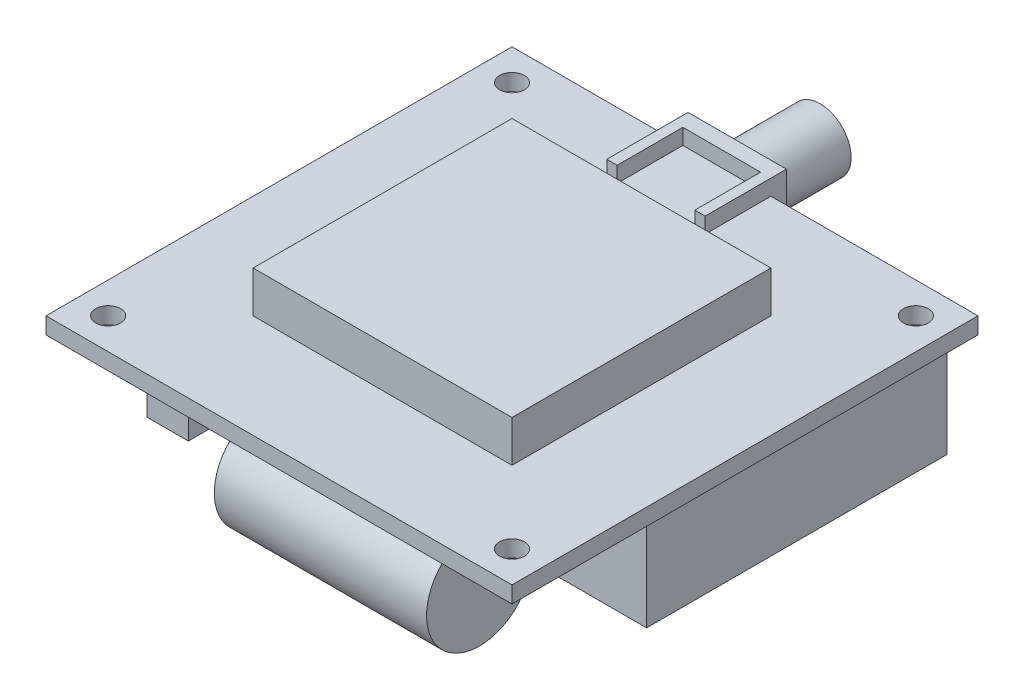
ISO-10303-21;
HEADER;
FILE_DESCRIPTION(('STEP AP214'),'2;1');
FILE_NAME('part.step','',(''),(''),'','','');
FILE_SCHEMA(('AUTOMOTIVE_DESIGN { 1 0 10303 214 1 1 1 1 }'));
ENDSEC;
DATA;
#1=APPLICATION_CONTEXT('core data for automotive mechanical design processes');
#2=APPLICATION_PROTOCOL_DEFINITION('international standard','automotive_design',2000,#1);
#3=PRODUCT_CONTEXT('',#1,'mechanical');
#4=PRODUCT('Part','Part','',(#3));
#5=PRODUCT_RELATED_PRODUCT_CATEGORY('part','',(#4));
#6=PRODUCT_DEFINITION_FORMATION('','',#4);
#7=PRODUCT_DEFINITION_CONTEXT('part definition',#1,'design');
#8=PRODUCT_DEFINITION('design','',#6,#7);
#9=PRODUCT_DEFINITION_SHAPE('','',#8);
#10=(LENGTH_UNIT() NAMED_UNIT(*) SI_UNIT(.MILLI.,.METRE.));
#11=(NAMED_UNIT(*) PLANE_ANGLE_UNIT() SI_UNIT($,.RADIAN.));
#12=(NAMED_UNIT(*) SI_UNIT($,.STERADIAN.) SOLID_ANGLE_UNIT());
#13=UNCERTAINTY_MEASURE_WITH_UNIT(LENGTH_MEASURE(1.E-05),#10,'distance_accuracy_value','');
#14=(GEOMETRIC_REPRESENTATION_CONTEXT(3) GLOBAL_UNCERTAINTY_ASSIGNED_CONTEXT((#13)) GLOBAL_UNIT_ASSIGNED_CONTEXT((#10,
#11,#12)) REPRESENTATION_CONTEXT('',''));
#15=CARTESIAN_POINT('',(0.,0.,0.));
#16=DIRECTION('',(0.,0.,1.));
#17=DIRECTION('',(1.,0.,0.));
#18=AXIS2_PLACEMENT_3D('',#15,#16,#17);
#19=CARTESIAN_POINT('',(-17.4,-5.1,-0.999999999999997));
#20=DIRECTION('',(0.,0.,-1.));
#21=DIRECTION('',(-1.,0.,0.));
#22=AXIS2_PLACEMENT_3D('',#19,#20,#21);
#23=CYLINDRICAL_SURFACE('',#22,5.1);
#24=CARTESIAN_POINT('',(-17.4,-5.1,-0.999999999999997));
#25=DIRECTION('',(0.,0.,-1.));
#26=DIRECTION('',(-1.,0.,0.));
#27=AXIS2_PLACEMENT_3D('',#24,#25,#26);
#28=CIRCLE('',#27,5.1);
#29=CARTESIAN_POINT('',(-22.5,-5.1,-0.999999999999997));
#30=VERTEX_POINT('',#29);
#31=EDGE_CURVE('E11',#30,#30,#28,.T.);
#32=ORIENTED_EDGE('',*,*,#31,.T.);
#33=EDGE_LOOP('',(#32));
#34=FACE_BOUND('',#33,.T.);
#35=CARTESIAN_POINT('',(-17.4,-5.1,-21.5));
#36=DIRECTION('',(0.,0.,-1.));
#37=DIRECTION('',(-1.,0.,0.));
#38=AXIS2_PLACEMENT_3D('',#35,#36,#37);
#39=CIRCLE('',#38,5.1);
#40=CARTESIAN_POINT('',(-22.5,-5.1,-21.5));
#41=VERTEX_POINT('',#40);
#42=EDGE_CURVE('E43',#41,#41,#39,.T.);
#43=ORIENTED_EDGE('',*,*,#42,.F.);
#44=EDGE_LOOP('',(#43));
#45=FACE_BOUND('',#44,.T.);
#46=ADVANCED_FACE('F40',(#34,#45),#23,.T.);
#47=CARTESIAN_POINT('',(-17.4,-5.1,-0.999999999999997));
#48=DIRECTION('',(0.,0.,-1.));
#49=DIRECTION('',(-1.,0.,0.));
#50=AXIS2_PLACEMENT_3D('',#47,#48,#49);
#51=PLANE('',#50);
#52=ORIENTED_EDGE('',*,*,#31,.F.);
#53=EDGE_LOOP('',(#52));
#54=FACE_BOUND('',#53,.T.);
#55=ADVANCED_FACE('F55',(#54),#51,.F.);
#56=CARTESIAN_POINT('',(-17.4,-5.1,-21.5));
#57=DIRECTION('',(0.,0.,-1.));
#58=DIRECTION('',(-1.,0.,0.));
#59=AXIS2_PLACEMENT_3D('',#56,#57,#58);
#60=PLANE('',#59);
#61=ORIENTED_EDGE('',*,*,#42,.T.);
#62=EDGE_LOOP('',(#61));
#63=FACE_BOUND('',#62,.T.);
#64=ADVANCED_FACE('F52',(#63),#60,.T.);
#65=CLOSED_SHELL('',(#46,#55,#64));
#66=MANIFOLD_SOLID_BREP('B2',#65);
#67=CARTESIAN_POINT('',(-6.25,-5.1,17.4));
#68=DIRECTION('',(1.,0.,0.));
#69=DIRECTION('',(0.,0.,-1.));
#70=AXIS2_PLACEMENT_3D('',#67,#68,#69);
#71=CYLINDRICAL_SURFACE('',#70,5.1);
#72=CARTESIAN_POINT('',(-6.25,-5.1,17.4));
#73=DIRECTION('',(1.,0.,0.));
#74=DIRECTION('',(0.,0.,-1.));
#75=AXIS2_PLACEMENT_3D('',#72,#73,#74);
#76=CIRCLE('',#75,5.1);
#77=CARTESIAN_POINT('',(-6.25,-5.1,12.3));
#78=VERTEX_POINT('',#77);
#79=EDGE_CURVE('E39',#78,#78,#76,.T.);
#80=ORIENTED_EDGE('',*,*,#79,.T.);
#81=EDGE_LOOP('',(#80));
#82=FACE_BOUND('',#81,.T.);
#83=CARTESIAN_POINT('',(14.25,-5.1,17.4));
#84=DIRECTION('',(1.,0.,0.));
#85=DIRECTION('',(0.,0.,-1.));
#86=AXIS2_PLACEMENT_3D('',#83,#84,#85);
#87=CIRCLE('',#86,5.1);
#88=CARTESIAN_POINT('',(14.25,-5.1,12.3));
#89=VERTEX_POINT('',#88);
#90=EDGE_CURVE('E93',#89,#89,#87,.T.);
#91=ORIENTED_EDGE('',*,*,#90,.F.);
#92=EDGE_LOOP('',(#91));
#93=FACE_BOUND('',#92,.T.);
#94=ADVANCED_FACE('F90',(#82,#93),#71,.T.);
#95=CARTESIAN_POINT('',(-6.25,-5.1,17.4));
#96=DIRECTION('',(1.,0.,0.));
#97=DIRECTION('',(0.,0.,-1.));
#98=AXIS2_PLACEMENT_3D('',#95,#96,#97);
#99=PLANE('',#98);
#100=ORIENTED_EDGE('',*,*,#79,.F.);
#101=EDGE_LOOP('',(#100));
#102=FACE_BOUND('',#101,.T.);
#103=ADVANCED_FACE('F105',(#102),#99,.F.);
#104=CARTESIAN_POINT('',(14.25,-5.1,17.4));
#105=DIRECTION('',(1.,0.,0.));
#106=DIRECTION('',(0.,0.,-1.));
#107=AXIS2_PLACEMENT_3D('',#104,#105,#106);
#108=PLANE('',#107);
#109=ORIENTED_EDGE('',*,*,#90,.T.);
#110=EDGE_LOOP('',(#109));
#111=FACE_BOUND('',#110,.T.);
#112=ADVANCED_FACE('F102',(#111),#108,.T.);
#113=CLOSED_SHELL('',(#94,#103,#112));
#114=MANIFOLD_SOLID_BREP('B6',#113);
#115=CARTESIAN_POINT('',(0.,1.6,0.));
#116=DIRECTION('',(0.,-1.,0.));
#117=DIRECTION('',(0.,0.,-1.));
#118=AXIS2_PLACEMENT_3D('',#115,#116,#117);
#119=PLANE('',#118);
#120=DIRECTION('',(0.,0.,-1.));
#121=VECTOR('',#120,1.);
#122=CARTESIAN_POINT('',(2.5,1.6,-16.15));
#123=LINE('',#122,#121);
#124=CARTESIAN_POINT('',(2.5,1.6,-16.15));
#125=VERTEX_POINT('',#124);
#126=CARTESIAN_POINT('',(2.49999999999999,1.6,-22.5));
#127=VERTEX_POINT('',#126);
#128=EDGE_CURVE('E377',#125,#127,#123,.T.);
#129=ORIENTED_EDGE('',*,*,#128,.F.);
#130=DIRECTION('',(1.,0.,0.));
#131=VECTOR('',#130,1.);
#132=CARTESIAN_POINT('',(2.5,1.6,-16.15));
#133=LINE('',#132,#131);
#134=CARTESIAN_POINT('',(1.5,1.6,-16.15));
#135=VERTEX_POINT('',#134);
#136=EDGE_CURVE('E375',#135,#125,#133,.T.);
#137=ORIENTED_EDGE('',*,*,#136,.F.);
#138=DIRECTION('',(0.,0.,-1.));
#139=VECTOR('',#138,1.);
#140=CARTESIAN_POINT('',(1.5,1.6,-16.15));
#141=LINE('',#140,#139);
#142=CARTESIAN_POINT('',(1.5,1.6,-22.5));
#143=VERTEX_POINT('',#142);
#144=EDGE_CURVE('E380',#135,#143,#141,.T.);
#145=ORIENTED_EDGE('',*,*,#144,.T.);
#146=DIRECTION('',(-1.,0.,0.));
#147=VECTOR('',#146,1.);
#148=CARTESIAN_POINT('',(-22.5,1.6,-22.5));
#149=LINE('',#148,#147);
#150=CARTESIAN_POINT('',(-6.,1.6,-22.5));
#151=VERTEX_POINT('',#150);
#152=EDGE_CURVE('E500',#143,#151,#149,.T.);
#153=ORIENTED_EDGE('',*,*,#152,.T.);
#154=DIRECTION('',(0.,0.,-1.));
#155=VECTOR('',#154,1.);
#156=CARTESIAN_POINT('',(-6.,1.6,-16.15));
#157=LINE('',#156,#155);
#158=CARTESIAN_POINT('',(-6.,1.6,-16.15));
#159=VERTEX_POINT('',#158);
#160=EDGE_CURVE('E399',#159,#151,#157,.T.);
#161=ORIENTED_EDGE('',*,*,#160,.F.);
#162=DIRECTION('',(1.,0.,0.));
#163=VECTOR('',#162,1.);
#164=CARTESIAN_POINT('',(-7.,1.6,-16.15));
#165=LINE('',#164,#163);
#166=CARTESIAN_POINT('',(-7.,1.6,-16.15));
#167=VERTEX_POINT('',#166);
#168=EDGE_CURVE('E388',#167,#159,#165,.T.);
#169=ORIENTED_EDGE('',*,*,#168,.F.);
#170=DIRECTION('',(0.,0.,-1.));
#171=VECTOR('',#170,1.);
#172=CARTESIAN_POINT('',(-7.,1.6,-16.15));
#173=LINE('',#172,#171);
#174=CARTESIAN_POINT('',(-7.,1.6,-22.5));
#175=VERTEX_POINT('',#174);
#176=EDGE_CURVE('E402',#167,#175,#173,.T.);
#177=ORIENTED_EDGE('',*,*,#176,.T.);
#178=CARTESIAN_POINT('',(-22.5,1.6,-22.5));
#179=VERTEX_POINT('',#178);
#180=EDGE_CURVE('E494',#175,#179,#149,.T.);
#181=ORIENTED_EDGE('',*,*,#180,.T.);
#182=DIRECTION('',(0.,0.,1.));
#183=VECTOR('',#182,1.);
#184=CARTESIAN_POINT('',(-22.5,1.6,22.5));
#185=LINE('',#184,#183);
#186=CARTESIAN_POINT('',(-22.5,1.6,22.5));
#187=VERTEX_POINT('',#186);
#188=EDGE_CURVE('E499',#179,#187,#185,.T.);
#189=ORIENTED_EDGE('',*,*,#188,.T.);
#190=DIRECTION('',(1.,0.,0.));
#191=VECTOR('',#190,1.);
#192=CARTESIAN_POINT('',(-22.5,1.6,22.5));
#193=LINE('',#192,#191);
#194=CARTESIAN_POINT('',(22.5,1.6,22.5));
#195=VERTEX_POINT('',#194);
#196=EDGE_CURVE('E502',#187,#195,#193,.T.);
#197=ORIENTED_EDGE('',*,*,#196,.T.);
#198=DIRECTION('',(0.,0.,-1.));
#199=VECTOR('',#198,1.);
#200=CARTESIAN_POINT('',(22.5,1.6,22.5));
#201=LINE('',#200,#199);
#202=CARTESIAN_POINT('',(22.5,1.6,-22.5));
#203=VERTEX_POINT('',#202);
#204=EDGE_CURVE('E491',#195,#203,#201,.T.);
#205=ORIENTED_EDGE('',*,*,#204,.T.);
#206=EDGE_CURVE('E496',#203,#127,#149,.T.);
#207=ORIENTED_EDGE('',*,*,#206,.T.);
#208=EDGE_LOOP('',(#129,#137,#145,#153,#161,#169,#177,#181,#189,#197,#205,#207));
#209=FACE_BOUND('',#208,.T.);
#210=CARTESIAN_POINT('',(19.5,1.6,-19.5));
#211=DIRECTION('',(0.,-1.,0.));
#212=DIRECTION('',(0.,0.,-1.));
#213=AXIS2_PLACEMENT_3D('',#210,#211,#212);
#214=CIRCLE('',#213,1.2);
#215=CARTESIAN_POINT('',(19.5,1.6,-20.7));
#216=VERTEX_POINT('',#215);
#217=EDGE_CURVE('E487',#216,#216,#214,.T.);
#218=ORIENTED_EDGE('',*,*,#217,.T.);
#219=EDGE_LOOP('',(#218));
#220=FACE_BOUND('',#219,.T.);
#221=CARTESIAN_POINT('',(-19.5,1.6,19.5));
#222=DIRECTION('',(0.,-1.,0.));
#223=DIRECTION('',(0.,0.,-1.));
#224=AXIS2_PLACEMENT_3D('',#221,#222,#223);
#225=CIRCLE('',#224,1.2);
#226=CARTESIAN_POINT('',(-19.5,1.6,18.3));
#227=VERTEX_POINT('',#226);
#228=EDGE_CURVE('E484',#227,#227,#225,.T.);
#229=ORIENTED_EDGE('',*,*,#228,.T.);
#230=EDGE_LOOP('',(#229));
#231=FACE_BOUND('',#230,.T.);
#232=CARTESIAN_POINT('',(-19.5,1.6,-19.5));
#233=DIRECTION('',(0.,-1.,0.));
#234=DIRECTION('',(0.,0.,-1.));
#235=AXIS2_PLACEMENT_3D('',#232,#233,#234);
#236=CIRCLE('',#235,1.2);
#237=CARTESIAN_POINT('',(-19.5,1.6,-20.7));
#238=VERTEX_POINT('',#237);
#239=EDGE_CURVE('E478',#238,#238,#236,.T.);
#240=ORIENTED_EDGE('',*,*,#239,.T.);
#241=EDGE_LOOP('',(#240));
#242=FACE_BOUND('',#241,.T.);
#243=CARTESIAN_POINT('',(19.5,1.6,19.5));
#244=DIRECTION('',(0.,-1.,0.));
#245=DIRECTION('',(0.,0.,-1.));
#246=AXIS2_PLACEMENT_3D('',#243,#244,#245);
#247=CIRCLE('',#246,1.2);
#248=CARTESIAN_POINT('',(19.5,1.6,18.3));
#249=VERTEX_POINT('',#248);
#250=EDGE_CURVE('E472',#249,#249,#247,.T.);
#251=ORIENTED_EDGE('',*,*,#250,.T.);
#252=EDGE_LOOP('',(#251));
#253=FACE_BOUND('',#252,.T.);
#254=DIRECTION('',(0.,0.,-1.));
#255=VECTOR('',#254,1.);
#256=CARTESIAN_POINT('',(12.5,1.6,-12.5));
#257=LINE('',#256,#255);
#258=CARTESIAN_POINT('',(12.5,1.6,12.5));
#259=VERTEX_POINT('',#258);
#260=CARTESIAN_POINT('',(12.5,1.6,-12.5));
#261=VERTEX_POINT('',#260);
#262=EDGE_CURVE('E332',#259,#261,#257,.T.);
#263=ORIENTED_EDGE('',*,*,#262,.F.);
#264=DIRECTION('',(1.,0.,0.));
#265=VECTOR('',#264,1.);
#266=CARTESIAN_POINT('',(12.5,1.6,12.5));
#267=LINE('',#266,#265);
#268=CARTESIAN_POINT('',(-12.5,1.6,12.5));
#269=VERTEX_POINT('',#268);
#270=EDGE_CURVE('E329',#269,#259,#267,.T.);
#271=ORIENTED_EDGE('',*,*,#270,.F.);
#272=DIRECTION('',(0.,0.,1.));
#273=VECTOR('',#272,1.);
#274=CARTESIAN_POINT('',(-12.5,1.6,-12.5));
#275=LINE('',#274,#273);
#276=CARTESIAN_POINT('',(-12.5,1.6,-12.5));
#277=VERTEX_POINT('',#276);
#278=EDGE_CURVE('E153',#277,#269,#275,.T.);
#279=ORIENTED_EDGE('',*,*,#278,.F.);
#280=DIRECTION('',(-1.,0.,0.));
#281=VECTOR('',#280,1.);
#282=CARTESIAN_POINT('',(12.5,1.6,-12.5));
#283=LINE('',#282,#281);
#284=EDGE_CURVE('E148',#261,#277,#283,.T.);
#285=ORIENTED_EDGE('',*,*,#284,.F.);
#286=EDGE_LOOP('',(#263,#271,#279,#285));
#287=FACE_BOUND('',#286,.T.);
#288=ADVANCED_FACE('F131',(#209,#220,#231,#242,#253,#287),#119,.F.);
#289=CARTESIAN_POINT('',(0.,0.,0.));
#290=DIRECTION('',(0.,-1.,0.));
#291=DIRECTION('',(0.,0.,-1.));
#292=AXIS2_PLACEMENT_3D('',#289,#290,#291);
#293=PLANE('',#292);
#294=DIRECTION('',(0.,0.,-1.));
#295=VECTOR('',#294,1.);
#296=CARTESIAN_POINT('',(22.5,0.,22.5));
#297=LINE('',#296,#295);
#298=CARTESIAN_POINT('',(22.5,0.,22.5));
#299=VERTEX_POINT('',#298);
#300=CARTESIAN_POINT('',(22.5,0.,-22.5));
#301=VERTEX_POINT('',#300);
#302=EDGE_CURVE('E490',#299,#301,#297,.T.);
#303=ORIENTED_EDGE('',*,*,#302,.F.);
#304=DIRECTION('',(1.,0.,0.));
#305=VECTOR('',#304,1.);
#306=CARTESIAN_POINT('',(-22.5,0.,22.5));
#307=LINE('',#306,#305);
#308=CARTESIAN_POINT('',(-22.5,0.,22.5));
#309=VERTEX_POINT('',#308);
#310=EDGE_CURVE('E495',#309,#299,#307,.T.);
#311=ORIENTED_EDGE('',*,*,#310,.F.);
#312=DIRECTION('',(0.,0.,1.));
#313=VECTOR('',#312,1.);
#314=CARTESIAN_POINT('',(-22.5,0.,22.5));
#315=LINE('',#314,#313);
#316=CARTESIAN_POINT('',(-22.5,0.,-22.5));
#317=VERTEX_POINT('',#316);
#318=EDGE_CURVE('E510',#317,#309,#315,.T.);
#319=ORIENTED_EDGE('',*,*,#318,.F.);
#320=DIRECTION('',(-1.,0.,0.));
#321=VECTOR('',#320,1.);
#322=CARTESIAN_POINT('',(-22.5,0.,-22.5));
#323=LINE('',#322,#321);
#324=CARTESIAN_POINT('',(-7.,0.,-22.5));
#325=VERTEX_POINT('',#324);
#326=EDGE_CURVE('E507',#325,#317,#323,.T.);
#327=ORIENTED_EDGE('',*,*,#326,.F.);
#328=CARTESIAN_POINT('',(2.5,0.,-22.5));
#329=VERTEX_POINT('',#328);
#330=EDGE_CURVE('E511',#329,#325,#323,.T.);
#331=ORIENTED_EDGE('',*,*,#330,.F.);
#332=EDGE_CURVE('E508',#301,#329,#323,.T.);
#333=ORIENTED_EDGE('',*,*,#332,.F.);
#334=EDGE_LOOP('',(#303,#311,#319,#327,#331,#333));
#335=FACE_BOUND('',#334,.T.);
#336=CARTESIAN_POINT('',(-19.5,0.,19.5));
#337=DIRECTION('',(0.,-1.,0.));
#338=DIRECTION('',(0.,0.,-1.));
#339=AXIS2_PLACEMENT_3D('',#336,#337,#338);
#340=CIRCLE('',#339,1.2);
#341=CARTESIAN_POINT('',(-19.5,0.,18.3));
#342=VERTEX_POINT('',#341);
#343=EDGE_CURVE('E481',#342,#342,#340,.T.);
#344=ORIENTED_EDGE('',*,*,#343,.F.);
#345=EDGE_LOOP('',(#344));
#346=FACE_BOUND('',#345,.T.);
#347=CARTESIAN_POINT('',(-19.5,0.,-19.5));
#348=DIRECTION('',(0.,-1.,0.));
#349=DIRECTION('',(0.,0.,-1.));
#350=AXIS2_PLACEMENT_3D('',#347,#348,#349);
#351=CIRCLE('',#350,1.2);
#352=CARTESIAN_POINT('',(-19.5,0.,-20.7));
#353=VERTEX_POINT('',#352);
#354=EDGE_CURVE('E475',#353,#353,#351,.T.);
#355=ORIENTED_EDGE('',*,*,#354,.F.);
#356=EDGE_LOOP('',(#355));
#357=FACE_BOUND('',#356,.T.);
#358=CARTESIAN_POINT('',(19.5,0.,19.5));
#359=DIRECTION('',(0.,-1.,0.));
#360=DIRECTION('',(0.,0.,-1.));
#361=AXIS2_PLACEMENT_3D('',#358,#359,#360);
#362=CIRCLE('',#361,1.2);
#363=CARTESIAN_POINT('',(19.5,0.,18.3));
#364=VERTEX_POINT('',#363);
#365=EDGE_CURVE('E469',#364,#364,#362,.T.);
#366=ORIENTED_EDGE('',*,*,#365,.F.);
#367=EDGE_LOOP('',(#366));
#368=FACE_BOUND('',#367,.T.);
#369=DIRECTION('',(1.,0.,0.));
#370=VECTOR('',#369,1.);
#371=CARTESIAN_POINT('',(-10.,0.,-21.));
#372=LINE('',#371,#370);
#373=CARTESIAN_POINT('',(-10.,0.,-21.));
#374=VERTEX_POINT('',#373);
#375=CARTESIAN_POINT('',(21.,0.,-21.));
#376=VERTEX_POINT('',#375);
#377=EDGE_CURVE('E451',#374,#376,#372,.T.);
#378=ORIENTED_EDGE('',*,*,#377,.F.);
#379=DIRECTION('',(0.,0.,-1.));
#380=VECTOR('',#379,1.);
#381=CARTESIAN_POINT('',(-10.,0.,8.00000000000001));
#382=LINE('',#381,#380);
#383=CARTESIAN_POINT('',(-10.,0.,8.00000000000001));
#384=VERTEX_POINT('',#383);
#385=EDGE_CURVE('E437',#384,#374,#382,.T.);
#386=ORIENTED_EDGE('',*,*,#385,.F.);
#387=DIRECTION('',(-1.,0.,0.));
#388=VECTOR('',#387,1.);
#389=CARTESIAN_POINT('',(-10.,0.,8.00000000000001));
#390=LINE('',#389,#388);
#391=CARTESIAN_POINT('',(21.,0.,8.00000000000001));
#392=VERTEX_POINT('',#391);
#393=EDGE_CURVE('E442',#392,#384,#390,.T.);
#394=ORIENTED_EDGE('',*,*,#393,.F.);
#395=DIRECTION('',(0.,0.,1.));
#396=VECTOR('',#395,1.);
#397=CARTESIAN_POINT('',(21.,0.,8.00000000000001));
#398=LINE('',#397,#396);
#399=EDGE_CURVE('E453',#376,#392,#398,.T.);
#400=ORIENTED_EDGE('',*,*,#399,.F.);
#401=EDGE_LOOP('',(#378,#386,#394,#400));
#402=FACE_BOUND('',#401,.T.);
#403=DIRECTION('',(-1.,0.,0.));
#404=VECTOR('',#403,1.);
#405=CARTESIAN_POINT('',(-11.75,0.,19.5));
#406=LINE('',#405,#404);
#407=CARTESIAN_POINT('',(-11.75,0.,19.5));
#408=VERTEX_POINT('',#407);
#409=CARTESIAN_POINT('',(-15.75,0.,19.5));
#410=VERTEX_POINT('',#409);
#411=EDGE_CURVE('E336',#408,#410,#406,.T.);
#412=ORIENTED_EDGE('',*,*,#411,.F.);
#413=DIRECTION('',(0.,0.,1.));
#414=VECTOR('',#413,1.);
#415=CARTESIAN_POINT('',(-11.75,0.,19.5));
#416=LINE('',#415,#414);
#417=CARTESIAN_POINT('',(-11.75,0.,1.7));
#418=VERTEX_POINT('',#417);
#419=EDGE_CURVE('E333',#418,#408,#416,.T.);
#420=ORIENTED_EDGE('',*,*,#419,.F.);
#421=DIRECTION('',(1.,0.,0.));
#422=VECTOR('',#421,1.);
#423=CARTESIAN_POINT('',(-11.75,0.,1.7));
#424=LINE('',#423,#422);
#425=CARTESIAN_POINT('',(-15.75,0.,1.7));
#426=VERTEX_POINT('',#425);
#427=EDGE_CURVE('E346',#426,#418,#424,.T.);
#428=ORIENTED_EDGE('',*,*,#427,.F.);
#429=DIRECTION('',(0.,0.,-1.));
#430=VECTOR('',#429,1.);
#431=CARTESIAN_POINT('',(-15.75,0.,19.5));
#432=LINE('',#431,#430);
#433=EDGE_CURVE('E354',#410,#426,#432,.T.);
#434=ORIENTED_EDGE('',*,*,#433,.F.);
#435=EDGE_LOOP('',(#412,#420,#428,#434));
#436=FACE_BOUND('',#435,.T.);
#437=ADVANCED_FACE('F545',(#335,#346,#357,#368,#402,#436),#293,.T.);
#438=CARTESIAN_POINT('',(0.,0.,-22.5));
#439=DIRECTION('',(0.,0.,1.));
#440=DIRECTION('',(1.,0.,0.));
#441=AXIS2_PLACEMENT_3D('',#438,#439,#440);
#442=PLANE('',#441);
#443=ORIENTED_EDGE('',*,*,#152,.F.);
#444=DIRECTION('',(0.,-1.,0.));
#445=VECTOR('',#444,1.);
#446=CARTESIAN_POINT('',(1.5,3.11510230791612,-22.5));
#447=LINE('',#446,#445);
#448=CARTESIAN_POINT('',(1.5,3.11510230791612,-22.5));
#449=VERTEX_POINT('',#448);
#450=EDGE_CURVE('E367',#449,#143,#447,.T.);
#451=ORIENTED_EDGE('',*,*,#450,.F.);
#452=DIRECTION('',(1.,0.,0.));
#453=VECTOR('',#452,1.);
#454=CARTESIAN_POINT('',(-7.,3.11510230791612,-22.5));
#455=LINE('',#454,#453);
#456=CARTESIAN_POINT('',(-6.,3.11510230791612,-22.5));
#457=VERTEX_POINT('',#456);
#458=EDGE_CURVE('E421',#457,#449,#455,.T.);
#459=ORIENTED_EDGE('',*,*,#458,.F.);
#460=DIRECTION('',(0.,1.,0.));
#461=VECTOR('',#460,1.);
#462=CARTESIAN_POINT('',(-6.,3.11510230791612,-22.5));
#463=LINE('',#462,#461);
#464=EDGE_CURVE('E385',#151,#457,#463,.T.);
#465=ORIENTED_EDGE('',*,*,#464,.F.);
#466=EDGE_LOOP('',(#443,#451,#459,#465));
#467=FACE_BOUND('',#466,.T.);
#468=ADVANCED_FACE('F596',(#467),#442,.T.);
#469=CARTESIAN_POINT('',(-22.5,1.6,-22.5));
#470=DIRECTION('',(0.,0.,1.));
#471=DIRECTION('',(1.,0.,0.));
#472=AXIS2_PLACEMENT_3D('',#469,#470,#471);
#473=PLANE('',#472);
#474=DIRECTION('',(0.,1.,0.));
#475=VECTOR('',#474,1.);
#476=CARTESIAN_POINT('',(-7.,3.11510230791612,-22.5));
#477=LINE('',#476,#475);
#478=EDGE_CURVE('E140',#325,#175,#477,.T.);
#479=ORIENTED_EDGE('',*,*,#478,.F.);
#480=ORIENTED_EDGE('',*,*,#326,.T.);
#481=DIRECTION('',(0.,-1.,0.));
#482=VECTOR('',#481,1.);
#483=CARTESIAN_POINT('',(-22.5,1.6,-22.5));
#484=LINE('',#483,#482);
#485=EDGE_CURVE('E518',#179,#317,#484,.T.);
#486=ORIENTED_EDGE('',*,*,#485,.F.);
#487=ORIENTED_EDGE('',*,*,#180,.F.);
#488=EDGE_LOOP('',(#479,#480,#486,#487));
#489=FACE_BOUND('',#488,.T.);
#490=ADVANCED_FACE('F540',(#489),#473,.F.);
#491=DIRECTION('',(0.,-1.,0.));
#492=VECTOR('',#491,1.);
#493=CARTESIAN_POINT('',(2.5,3.11510230791612,-22.5));
#494=LINE('',#493,#492);
#495=EDGE_CURVE('E426',#127,#329,#494,.T.);
#496=ORIENTED_EDGE('',*,*,#495,.F.);
#497=ORIENTED_EDGE('',*,*,#206,.F.);
#498=DIRECTION('',(0.,-1.,0.));
#499=VECTOR('',#498,1.);
#500=CARTESIAN_POINT('',(22.5,1.6,-22.5));
#501=LINE('',#500,#499);
#502=EDGE_CURVE('E135',#203,#301,#501,.T.);
#503=ORIENTED_EDGE('',*,*,#502,.T.);
#504=ORIENTED_EDGE('',*,*,#332,.T.);
#505=EDGE_LOOP('',(#496,#497,#503,#504));
#506=FACE_BOUND('',#505,.T.);
#507=ADVANCED_FACE('F578',(#506),#473,.F.);
#508=CARTESIAN_POINT('',(22.5,1.6,22.5));
#509=DIRECTION('',(-1.,0.,0.));
#510=DIRECTION('',(0.,0.,1.));
#511=AXIS2_PLACEMENT_3D('',#508,#509,#510);
#512=PLANE('',#511);
#513=ORIENTED_EDGE('',*,*,#302,.T.);
#514=ORIENTED_EDGE('',*,*,#502,.F.);
#515=ORIENTED_EDGE('',*,*,#204,.F.);
#516=DIRECTION('',(0.,-1.,0.));
#517=VECTOR('',#516,1.);
#518=CARTESIAN_POINT('',(22.5,1.6,22.5));
#519=LINE('',#518,#517);
#520=EDGE_CURVE('E504',#195,#299,#519,.T.);
#521=ORIENTED_EDGE('',*,*,#520,.T.);
#522=EDGE_LOOP('',(#513,#514,#515,#521));
#523=FACE_BOUND('',#522,.T.);
#524=ADVANCED_FACE('F133',(#523),#512,.F.);
#525=CARTESIAN_POINT('',(-22.5,1.6,22.5));
#526=DIRECTION('',(1.,0.,0.));
#527=DIRECTION('',(0.,0.,-1.));
#528=AXIS2_PLACEMENT_3D('',#525,#526,#527);
#529=PLANE('',#528);
#530=ORIENTED_EDGE('',*,*,#318,.T.);
#531=DIRECTION('',(0.,-1.,0.));
#532=VECTOR('',#531,1.);
#533=CARTESIAN_POINT('',(-22.5,1.6,22.5));
#534=LINE('',#533,#532);
#535=EDGE_CURVE('E516',#187,#309,#534,.T.);
#536=ORIENTED_EDGE('',*,*,#535,.F.);
#537=ORIENTED_EDGE('',*,*,#188,.F.);
#538=ORIENTED_EDGE('',*,*,#485,.T.);
#539=EDGE_LOOP('',(#530,#536,#537,#538));
#540=FACE_BOUND('',#539,.T.);
#541=ADVANCED_FACE('F586',(#540),#529,.F.);
#542=CARTESIAN_POINT('',(-22.5,1.6,22.5));
#543=DIRECTION('',(0.,0.,-1.));
#544=DIRECTION('',(-1.,0.,0.));
#545=AXIS2_PLACEMENT_3D('',#542,#543,#544);
#546=PLANE('',#545);
#547=ORIENTED_EDGE('',*,*,#310,.T.);
#548=ORIENTED_EDGE('',*,*,#520,.F.);
#549=ORIENTED_EDGE('',*,*,#196,.F.);
#550=ORIENTED_EDGE('',*,*,#535,.T.);
#551=EDGE_LOOP('',(#547,#548,#549,#550));
#552=FACE_BOUND('',#551,.T.);
#553=ADVANCED_FACE('F584',(#552),#546,.F.);
#554=CARTESIAN_POINT('',(19.5,0.,-19.5));
#555=DIRECTION('',(0.,-1.,0.));
#556=DIRECTION('',(0.,0.,-1.));
#557=AXIS2_PLACEMENT_3D('',#554,#555,#556);
#558=CYLINDRICAL_SURFACE('',#557,1.2);
#559=ORIENTED_EDGE('',*,*,#217,.F.);
#560=EDGE_LOOP('',(#559));
#561=FACE_BOUND('',#560,.T.);
#562=CARTESIAN_POINT('',(19.5,0.,-19.5));
#563=DIRECTION('',(0.,-1.,0.));
#564=DIRECTION('',(0.,0.,-1.));
#565=AXIS2_PLACEMENT_3D('',#562,#563,#564);
#566=CIRCLE('',#565,1.2);
#567=CARTESIAN_POINT('',(19.5,0.,-20.7));
#568=VERTEX_POINT('',#567);
#569=EDGE_CURVE('E466',#568,#568,#566,.F.);
#570=ORIENTED_EDGE('',*,*,#569,.F.);
#571=EDGE_LOOP('',(#570));
#572=FACE_BOUND('',#571,.T.);
#573=ADVANCED_FACE('F618',(#561,#572),#558,.F.);
#574=CARTESIAN_POINT('',(-19.5,0.,19.5));
#575=DIRECTION('',(0.,-1.,0.));
#576=DIRECTION('',(0.,0.,-1.));
#577=AXIS2_PLACEMENT_3D('',#574,#575,#576);
#578=CYLINDRICAL_SURFACE('',#577,1.2);
#579=ORIENTED_EDGE('',*,*,#228,.F.);
#580=EDGE_LOOP('',(#579));
#581=FACE_BOUND('',#580,.T.);
#582=ORIENTED_EDGE('',*,*,#343,.T.);
#583=EDGE_LOOP('',(#582));
#584=FACE_BOUND('',#583,.T.);
#585=ADVANCED_FACE('F956',(#581,#584),#578,.F.);
#586=CARTESIAN_POINT('',(-19.5,0.,-19.5));
#587=DIRECTION('',(0.,-1.,0.));
#588=DIRECTION('',(0.,0.,-1.));
#589=AXIS2_PLACEMENT_3D('',#586,#587,#588);
#590=CYLINDRICAL_SURFACE('',#589,1.2);
#591=ORIENTED_EDGE('',*,*,#239,.F.);
#592=EDGE_LOOP('',(#591));
#593=FACE_BOUND('',#592,.T.);
#594=ORIENTED_EDGE('',*,*,#354,.T.);
#595=EDGE_LOOP('',(#594));
#596=FACE_BOUND('',#595,.T.);
#597=ADVANCED_FACE('F946',(#593,#596),#590,.F.);
#598=CARTESIAN_POINT('',(19.5,0.,19.5));
#599=DIRECTION('',(0.,-1.,0.));
#600=DIRECTION('',(0.,0.,-1.));
#601=AXIS2_PLACEMENT_3D('',#598,#599,#600);
#602=CYLINDRICAL_SURFACE('',#601,1.2);
#603=ORIENTED_EDGE('',*,*,#250,.F.);
#604=EDGE_LOOP('',(#603));
#605=FACE_BOUND('',#604,.T.);
#606=ORIENTED_EDGE('',*,*,#365,.T.);
#607=EDGE_LOOP('',(#606));
#608=FACE_BOUND('',#607,.T.);
#609=ADVANCED_FACE('F936',(#605,#608),#602,.F.);
#610=CARTESIAN_POINT('',(0.,0.,0.));
#611=DIRECTION('',(0.,-1.,0.));
#612=DIRECTION('',(0.,0.,-1.));
#613=AXIS2_PLACEMENT_3D('',#610,#611,#612);
#614=PLANE('',#613);
#615=ORIENTED_EDGE('',*,*,#569,.T.);
#616=EDGE_LOOP('',(#615));
#617=FACE_BOUND('',#616,.T.);
#618=ADVANCED_FACE('F926',(#617),#614,.F.);
#619=CARTESIAN_POINT('',(-10.,-10.,8.00000000000001));
#620=DIRECTION('',(1.,0.,0.));
#621=DIRECTION('',(0.,0.,-1.));
#622=AXIS2_PLACEMENT_3D('',#619,#620,#621);
#623=PLANE('',#622);
#624=ORIENTED_EDGE('',*,*,#385,.T.);
#625=DIRECTION('',(0.,1.,0.));
#626=VECTOR('',#625,1.);
#627=CARTESIAN_POINT('',(-10.,-10.,-21.));
#628=LINE('',#627,#626);
#629=CARTESIAN_POINT('',(-10.,-10.,-21.));
#630=VERTEX_POINT('',#629);
#631=EDGE_CURVE('E464',#630,#374,#628,.T.);
#632=ORIENTED_EDGE('',*,*,#631,.F.);
#633=DIRECTION('',(0.,0.,-1.));
#634=VECTOR('',#633,1.);
#635=CARTESIAN_POINT('',(-10.,-10.,8.00000000000001));
#636=LINE('',#635,#634);
#637=CARTESIAN_POINT('',(-10.,-10.,8.00000000000001));
#638=VERTEX_POINT('',#637);
#639=EDGE_CURVE('E438',#638,#630,#636,.T.);
#640=ORIENTED_EDGE('',*,*,#639,.F.);
#641=DIRECTION('',(0.,1.,0.));
#642=VECTOR('',#641,1.);
#643=CARTESIAN_POINT('',(-10.,-10.,8.00000000000001));
#644=LINE('',#643,#642);
#645=EDGE_CURVE('E448',#638,#384,#644,.T.);
#646=ORIENTED_EDGE('',*,*,#645,.T.);
#647=EDGE_LOOP('',(#624,#632,#640,#646));
#648=FACE_BOUND('',#647,.T.);
#649=ADVANCED_FACE('F916',(#648),#623,.F.);
#650=CARTESIAN_POINT('',(-10.,-10.,-21.));
#651=DIRECTION('',(0.,0.,1.));
#652=DIRECTION('',(1.,0.,0.));
#653=AXIS2_PLACEMENT_3D('',#650,#651,#652);
#654=PLANE('',#653);
#655=ORIENTED_EDGE('',*,*,#377,.T.);
#656=DIRECTION('',(0.,1.,0.));
#657=VECTOR('',#656,1.);
#658=CARTESIAN_POINT('',(21.,-10.,-21.));
#659=LINE('',#658,#657);
#660=CARTESIAN_POINT('',(21.,-10.,-21.));
#661=VERTEX_POINT('',#660);
#662=EDGE_CURVE('E461',#661,#376,#659,.T.);
#663=ORIENTED_EDGE('',*,*,#662,.F.);
#664=DIRECTION('',(1.,0.,0.));
#665=VECTOR('',#664,1.);
#666=CARTESIAN_POINT('',(-10.,-10.,-21.));
#667=LINE('',#666,#665);
#668=EDGE_CURVE('E441',#630,#661,#667,.T.);
#669=ORIENTED_EDGE('',*,*,#668,.F.);
#670=ORIENTED_EDGE('',*,*,#631,.T.);
#671=EDGE_LOOP('',(#655,#663,#669,#670));
#672=FACE_BOUND('',#671,.T.);
#673=ADVANCED_FACE('F906',(#672),#654,.F.);
#674=CARTESIAN_POINT('',(21.,-10.,8.00000000000001));
#675=DIRECTION('',(-1.,0.,0.));
#676=DIRECTION('',(0.,0.,1.));
#677=AXIS2_PLACEMENT_3D('',#674,#675,#676);
#678=PLANE('',#677);
#679=ORIENTED_EDGE('',*,*,#399,.T.);
#680=DIRECTION('',(0.,1.,0.));
#681=VECTOR('',#680,1.);
#682=CARTESIAN_POINT('',(21.,-10.,8.00000000000001));
#683=LINE('',#682,#681);
#684=CARTESIAN_POINT('',(21.,-10.,8.00000000000001));
#685=VERTEX_POINT('',#684);
#686=EDGE_CURVE('E459',#685,#392,#683,.T.);
#687=ORIENTED_EDGE('',*,*,#686,.F.);
#688=DIRECTION('',(0.,0.,1.));
#689=VECTOR('',#688,1.);
#690=CARTESIAN_POINT('',(21.,-10.,8.00000000000001));
#691=LINE('',#690,#689);
#692=EDGE_CURVE('E444',#661,#685,#691,.T.);
#693=ORIENTED_EDGE('',*,*,#692,.F.);
#694=ORIENTED_EDGE('',*,*,#662,.T.);
#695=EDGE_LOOP('',(#679,#687,#693,#694));
#696=FACE_BOUND('',#695,.T.);
#697=ADVANCED_FACE('F896',(#696),#678,.F.);
#698=CARTESIAN_POINT('',(-10.,-10.,8.00000000000001));
#699=DIRECTION('',(0.,0.,-1.));
#700=DIRECTION('',(-1.,0.,0.));
#701=AXIS2_PLACEMENT_3D('',#698,#699,#700);
#702=PLANE('',#701);
#703=ORIENTED_EDGE('',*,*,#393,.T.);
#704=ORIENTED_EDGE('',*,*,#645,.F.);
#705=DIRECTION('',(-1.,0.,0.));
#706=VECTOR('',#705,1.);
#707=CARTESIAN_POINT('',(-10.,-10.,8.00000000000001));
#708=LINE('',#707,#706);
#709=EDGE_CURVE('E446',#685,#638,#708,.T.);
#710=ORIENTED_EDGE('',*,*,#709,.F.);
#711=ORIENTED_EDGE('',*,*,#686,.T.);
#712=EDGE_LOOP('',(#703,#704,#710,#711));
#713=FACE_BOUND('',#712,.T.);
#714=ADVANCED_FACE('F886',(#713),#702,.F.);
#715=CARTESIAN_POINT('',(0.,-10.,0.));
#716=DIRECTION('',(0.,-1.,0.));
#717=DIRECTION('',(0.,0.,-1.));
#718=AXIS2_PLACEMENT_3D('',#715,#716,#717);
#719=PLANE('',#718);
#720=ORIENTED_EDGE('',*,*,#639,.T.);
#721=ORIENTED_EDGE('',*,*,#668,.T.);
#722=ORIENTED_EDGE('',*,*,#692,.T.);
#723=ORIENTED_EDGE('',*,*,#709,.T.);
#724=EDGE_LOOP('',(#720,#721,#722,#723));
#725=FACE_BOUND('',#724,.T.);
#726=ADVANCED_FACE('F832',(#725),#719,.T.);
#727=CARTESIAN_POINT('',(-7.,3.11510230791612,-24.));
#728=DIRECTION('',(1.,0.,0.));
#729=DIRECTION('',(0.,0.,-1.));
#730=AXIS2_PLACEMENT_3D('',#727,#728,#729);
#731=PLANE('',#730);
#732=CARTESIAN_POINT('',(-7.,-4.68489769208388,-22.5));
#733=VERTEX_POINT('',#732);
#734=EDGE_CURVE('E406',#733,#325,#477,.T.);
#735=ORIENTED_EDGE('',*,*,#734,.T.);
#736=ORIENTED_EDGE('',*,*,#478,.T.);
#737=ORIENTED_EDGE('',*,*,#176,.F.);
#738=DIRECTION('',(0.,-1.,0.));
#739=VECTOR('',#738,1.);
#740=CARTESIAN_POINT('',(-7.,3.11510230791612,-16.15));
#741=LINE('',#740,#739);
#742=CARTESIAN_POINT('',(-7.,3.11510230791612,-16.15));
#743=VERTEX_POINT('',#742);
#744=EDGE_CURVE('E386',#743,#167,#741,.T.);
#745=ORIENTED_EDGE('',*,*,#744,.F.);
#746=DIRECTION('',(0.,0.,1.));
#747=VECTOR('',#746,1.);
#748=CARTESIAN_POINT('',(-7.,3.11510230791612,-24.));
#749=LINE('',#748,#747);
#750=CARTESIAN_POINT('',(-7.,3.11510230791612,-24.));
#751=VERTEX_POINT('',#750);
#752=EDGE_CURVE('E435',#751,#743,#749,.T.);
#753=ORIENTED_EDGE('',*,*,#752,.F.);
#754=DIRECTION('',(0.,1.,0.));
#755=VECTOR('',#754,1.);
#756=CARTESIAN_POINT('',(-7.,3.11510230791612,-24.));
#757=LINE('',#756,#755);
#758=CARTESIAN_POINT('',(-7.,-4.68489769208388,-24.));
#759=VERTEX_POINT('',#758);
#760=EDGE_CURVE('E408',#759,#751,#757,.T.);
#761=ORIENTED_EDGE('',*,*,#760,.F.);
#762=DIRECTION('',(0.,0.,1.));
#763=VECTOR('',#762,1.);
#764=CARTESIAN_POINT('',(-7.,-4.68489769208388,-24.));
#765=LINE('',#764,#763);
#766=EDGE_CURVE('E418',#759,#733,#765,.T.);
#767=ORIENTED_EDGE('',*,*,#766,.T.);
#768=EDGE_LOOP('',(#735,#736,#737,#745,#753,#761,#767));
#769=FACE_BOUND('',#768,.T.);
#770=ADVANCED_FACE('F533',(#769),#731,.F.);
#771=CARTESIAN_POINT('',(-7.,3.11510230791612,-24.));
#772=DIRECTION('',(0.,-1.,0.));
#773=DIRECTION('',(1.,0.,0.));
#774=AXIS2_PLACEMENT_3D('',#771,#772,#773);
#775=PLANE('',#774);
#776=ORIENTED_EDGE('',*,*,#752,.T.);
#777=DIRECTION('',(-1.,0.,0.));
#778=VECTOR('',#777,1.);
#779=CARTESIAN_POINT('',(-7.,3.11510230791612,-16.15));
#780=LINE('',#779,#778);
#781=CARTESIAN_POINT('',(-6.,3.11510230791612,-16.15));
#782=VERTEX_POINT('',#781);
#783=EDGE_CURVE('E392',#782,#743,#780,.T.);
#784=ORIENTED_EDGE('',*,*,#783,.F.);
#785=DIRECTION('',(0.,0.,-1.));
#786=VECTOR('',#785,1.);
#787=CARTESIAN_POINT('',(-6.,3.11510230791612,-16.15));
#788=LINE('',#787,#786);
#789=EDGE_CURVE('E395',#782,#457,#788,.T.);
#790=ORIENTED_EDGE('',*,*,#789,.T.);
#791=ORIENTED_EDGE('',*,*,#458,.T.);
#792=DIRECTION('',(0.,0.,-1.));
#793=VECTOR('',#792,1.);
#794=CARTESIAN_POINT('',(1.5,3.11510230791612,-16.15));
#795=LINE('',#794,#793);
#796=CARTESIAN_POINT('',(1.5,3.11510230791612,-16.15));
#797=VERTEX_POINT('',#796);
#798=EDGE_CURVE('E383',#797,#449,#795,.T.);
#799=ORIENTED_EDGE('',*,*,#798,.F.);
#800=DIRECTION('',(-1.,0.,0.));
#801=VECTOR('',#800,1.);
#802=CARTESIAN_POINT('',(2.5,3.11510230791612,-16.15));
#803=LINE('',#802,#801);
#804=CARTESIAN_POINT('',(2.5,3.11510230791612,-16.15));
#805=VERTEX_POINT('',#804);
#806=EDGE_CURVE('E371',#805,#797,#803,.T.);
#807=ORIENTED_EDGE('',*,*,#806,.F.);
#808=DIRECTION('',(0.,0.,1.));
#809=VECTOR('',#808,1.);
#810=CARTESIAN_POINT('',(2.5,3.11510230791612,-24.));
#811=LINE('',#810,#809);
#812=CARTESIAN_POINT('',(2.5,3.11510230791612,-24.));
#813=VERTEX_POINT('',#812);
#814=EDGE_CURVE('E433',#813,#805,#811,.T.);
#815=ORIENTED_EDGE('',*,*,#814,.F.);
#816=DIRECTION('',(1.,0.,0.));
#817=VECTOR('',#816,1.);
#818=CARTESIAN_POINT('',(-7.,3.11510230791612,-24.));
#819=LINE('',#818,#817);
#820=EDGE_CURVE('E411',#751,#813,#819,.T.);
#821=ORIENTED_EDGE('',*,*,#820,.F.);
#822=EDGE_LOOP('',(#776,#784,#790,#791,#799,#807,#815,#821));
#823=FACE_BOUND('',#822,.T.);
#824=ADVANCED_FACE('F569',(#823),#775,.F.);
#825=CARTESIAN_POINT('',(2.5,3.11510230791612,-24.));
#826=DIRECTION('',(-1.,0.,0.));
#827=DIRECTION('',(0.,-1.,0.));
#828=AXIS2_PLACEMENT_3D('',#825,#826,#827);
#829=PLANE('',#828);
#830=ORIENTED_EDGE('',*,*,#814,.T.);
#831=DIRECTION('',(0.,1.,0.));
#832=VECTOR('',#831,1.);
#833=CARTESIAN_POINT('',(2.5,3.11510230791612,-16.15));
#834=LINE('',#833,#832);
#835=EDGE_CURVE('E368',#125,#805,#834,.T.);
#836=ORIENTED_EDGE('',*,*,#835,.F.);
#837=ORIENTED_EDGE('',*,*,#128,.T.);
#838=ORIENTED_EDGE('',*,*,#495,.T.);
#839=CARTESIAN_POINT('',(2.5,-4.68489769208388,-22.5));
#840=VERTEX_POINT('',#839);
#841=EDGE_CURVE('E424',#329,#840,#494,.T.);
#842=ORIENTED_EDGE('',*,*,#841,.T.);
#843=DIRECTION('',(0.,0.,1.));
#844=VECTOR('',#843,1.);
#845=CARTESIAN_POINT('',(2.5,-4.68489769208388,-24.));
#846=LINE('',#845,#844);
#847=CARTESIAN_POINT('',(2.5,-4.68489769208388,-24.));
#848=VERTEX_POINT('',#847);
#849=EDGE_CURVE('E430',#848,#840,#846,.T.);
#850=ORIENTED_EDGE('',*,*,#849,.F.);
#851=DIRECTION('',(0.,-1.,0.));
#852=VECTOR('',#851,1.);
#853=CARTESIAN_POINT('',(2.5,3.11510230791612,-24.));
#854=LINE('',#853,#852);
#855=EDGE_CURVE('E414',#813,#848,#854,.T.);
#856=ORIENTED_EDGE('',*,*,#855,.F.);
#857=EDGE_LOOP('',(#830,#836,#837,#838,#842,#850,#856));
#858=FACE_BOUND('',#857,.T.);
#859=ADVANCED_FACE('F553',(#858),#829,.F.);
#860=CARTESIAN_POINT('',(-7.,-4.68489769208388,-24.));
#861=DIRECTION('',(0.,1.,0.));
#862=DIRECTION('',(-1.,0.,0.));
#863=AXIS2_PLACEMENT_3D('',#860,#861,#862);
#864=PLANE('',#863);
#865=DIRECTION('',(-1.,0.,0.));
#866=VECTOR('',#865,1.);
#867=CARTESIAN_POINT('',(-7.,-4.68489769208388,-22.5));
#868=LINE('',#867,#866);
#869=EDGE_CURVE('E412',#840,#733,#868,.T.);
#870=ORIENTED_EDGE('',*,*,#869,.T.);
#871=ORIENTED_EDGE('',*,*,#766,.F.);
#872=DIRECTION('',(-1.,0.,0.));
#873=VECTOR('',#872,1.);
#874=CARTESIAN_POINT('',(-7.,-4.68489769208388,-24.));
#875=LINE('',#874,#873);
#876=EDGE_CURVE('E416',#848,#759,#875,.T.);
#877=ORIENTED_EDGE('',*,*,#876,.F.);
#878=ORIENTED_EDGE('',*,*,#849,.T.);
#879=EDGE_LOOP('',(#870,#871,#877,#878));
#880=FACE_BOUND('',#879,.T.);
#881=ADVANCED_FACE('F557',(#880),#864,.F.);
#882=CARTESIAN_POINT('',(0.,0.,-24.));
#883=DIRECTION('',(0.,0.,1.));
#884=DIRECTION('',(1.,0.,0.));
#885=AXIS2_PLACEMENT_3D('',#882,#883,#884);
#886=PLANE('',#885);
#887=CARTESIAN_POINT('',(-2.25,-0.784897692083881,-24.));
#888=DIRECTION('',(0.,0.,-1.));
#889=DIRECTION('',(-1.,0.,0.));
#890=AXIS2_PLACEMENT_3D('',#887,#888,#889);
#891=CIRCLE('',#890,3.);
#892=CARTESIAN_POINT('',(-5.25,-0.784897692083881,-24.));
#893=VERTEX_POINT('',#892);
#894=EDGE_CURVE('E88',#893,#893,#891,.T.);
#895=ORIENTED_EDGE('',*,*,#894,.F.);
#896=EDGE_LOOP('',(#895));
#897=FACE_BOUND('',#896,.T.);
#898=ORIENTED_EDGE('',*,*,#760,.T.);
#899=ORIENTED_EDGE('',*,*,#820,.T.);
#900=ORIENTED_EDGE('',*,*,#855,.T.);
#901=ORIENTED_EDGE('',*,*,#876,.T.);
#902=EDGE_LOOP('',(#898,#899,#900,#901));
#903=FACE_BOUND('',#902,.T.);
#904=ADVANCED_FACE('F561',(#897,#903),#886,.F.);
#905=ORIENTED_EDGE('',*,*,#841,.F.);
#906=ORIENTED_EDGE('',*,*,#330,.T.);
#907=ORIENTED_EDGE('',*,*,#734,.F.);
#908=ORIENTED_EDGE('',*,*,#869,.F.);
#909=EDGE_LOOP('',(#905,#906,#907,#908));
#910=FACE_BOUND('',#909,.T.);
#911=ADVANCED_FACE('F550',(#910),#442,.T.);
#912=CARTESIAN_POINT('',(-2.25,-0.784897692083881,-32.));
#913=DIRECTION('',(0.,0.,1.));
#914=DIRECTION('',(1.,0.,0.));
#915=AXIS2_PLACEMENT_3D('',#912,#913,#914);
#916=CYLINDRICAL_SURFACE('',#915,3.);
#917=CARTESIAN_POINT('',(-2.25,-0.784897692083881,-32.));
#918=DIRECTION('',(0.,0.,-1.));
#919=DIRECTION('',(-1.,0.,0.));
#920=AXIS2_PLACEMENT_3D('',#917,#918,#919);
#921=CIRCLE('',#920,3.);
#922=CARTESIAN_POINT('',(-5.25,-0.784897692083881,-32.));
#923=VERTEX_POINT('',#922);
#924=EDGE_CURVE('E404',#923,#923,#921,.T.);
#925=ORIENTED_EDGE('',*,*,#924,.F.);
#926=EDGE_LOOP('',(#925));
#927=FACE_BOUND('',#926,.T.);
#928=ORIENTED_EDGE('',*,*,#894,.T.);
#929=EDGE_LOOP('',(#928));
#930=FACE_BOUND('',#929,.T.);
#931=ADVANCED_FACE('F635',(#927,#930),#916,.T.);
#932=CARTESIAN_POINT('',(-2.25,-0.784897692083881,-32.));
#933=DIRECTION('',(0.,0.,-1.));
#934=DIRECTION('',(-1.,0.,0.));
#935=AXIS2_PLACEMENT_3D('',#932,#933,#934);
#936=PLANE('',#935);
#937=ORIENTED_EDGE('',*,*,#924,.T.);
#938=EDGE_LOOP('',(#937));
#939=FACE_BOUND('',#938,.T.);
#940=ADVANCED_FACE('F609',(#939),#936,.T.);
#941=CARTESIAN_POINT('',(-6.,3.11510230791612,-16.15));
#942=DIRECTION('',(-1.,0.,0.));
#943=DIRECTION('',(0.,-1.,0.));
#944=AXIS2_PLACEMENT_3D('',#941,#942,#943);
#945=PLANE('',#944);
#946=ORIENTED_EDGE('',*,*,#464,.T.);
#947=ORIENTED_EDGE('',*,*,#789,.F.);
#948=DIRECTION('',(0.,1.,0.));
#949=VECTOR('',#948,1.);
#950=CARTESIAN_POINT('',(-6.,3.11510230791612,-16.15));
#951=LINE('',#950,#949);
#952=EDGE_CURVE('E390',#159,#782,#951,.T.);
#953=ORIENTED_EDGE('',*,*,#952,.F.);
#954=ORIENTED_EDGE('',*,*,#160,.T.);
#955=EDGE_LOOP('',(#946,#947,#953,#954));
#956=FACE_BOUND('',#955,.T.);
#957=ADVANCED_FACE('F593',(#956),#945,.F.);
#958=CARTESIAN_POINT('',(0.,0.,-16.15));
#959=DIRECTION('',(0.,0.,1.));
#960=DIRECTION('',(1.,0.,0.));
#961=AXIS2_PLACEMENT_3D('',#958,#959,#960);
#962=PLANE('',#961);
#963=ORIENTED_EDGE('',*,*,#744,.T.);
#964=ORIENTED_EDGE('',*,*,#168,.T.);
#965=ORIENTED_EDGE('',*,*,#952,.T.);
#966=ORIENTED_EDGE('',*,*,#783,.T.);
#967=EDGE_LOOP('',(#963,#964,#965,#966));
#968=FACE_BOUND('',#967,.T.);
#969=ADVANCED_FACE('F599',(#968),#962,.T.);
#970=CARTESIAN_POINT('',(1.5,3.11510230791612,-16.15));
#971=DIRECTION('',(1.,0.,0.));
#972=DIRECTION('',(0.,1.,0.));
#973=AXIS2_PLACEMENT_3D('',#970,#971,#972);
#974=PLANE('',#973);
#975=ORIENTED_EDGE('',*,*,#450,.T.);
#976=ORIENTED_EDGE('',*,*,#144,.F.);
#977=DIRECTION('',(0.,-1.,0.));
#978=VECTOR('',#977,1.);
#979=CARTESIAN_POINT('',(1.5,3.11510230791612,-16.15));
#980=LINE('',#979,#978);
#981=EDGE_CURVE('E373',#797,#135,#980,.T.);
#982=ORIENTED_EDGE('',*,*,#981,.F.);
#983=ORIENTED_EDGE('',*,*,#798,.T.);
#984=EDGE_LOOP('',(#975,#976,#982,#983));
#985=FACE_BOUND('',#984,.T.);
#986=ADVANCED_FACE('F601',(#985),#974,.F.);
#987=CARTESIAN_POINT('',(0.,0.,-16.15));
#988=DIRECTION('',(0.,0.,-1.));
#989=DIRECTION('',(-1.,0.,0.));
#990=AXIS2_PLACEMENT_3D('',#987,#988,#989);
#991=PLANE('',#990);
#992=ORIENTED_EDGE('',*,*,#835,.T.);
#993=ORIENTED_EDGE('',*,*,#806,.T.);
#994=ORIENTED_EDGE('',*,*,#981,.T.);
#995=ORIENTED_EDGE('',*,*,#136,.T.);
#996=EDGE_LOOP('',(#992,#993,#994,#995));
#997=FACE_BOUND('',#996,.T.);
#998=ADVANCED_FACE('F572',(#997),#991,.F.);
#999=CARTESIAN_POINT('',(-11.75,-5.,19.5));
#1000=DIRECTION('',(-1.,0.,0.));
#1001=DIRECTION('',(0.,0.,1.));
#1002=AXIS2_PLACEMENT_3D('',#999,#1000,#1001);
#1003=PLANE('',#1002);
#1004=ORIENTED_EDGE('',*,*,#419,.T.);
#1005=DIRECTION('',(0.,1.,0.));
#1006=VECTOR('',#1005,1.);
#1007=CARTESIAN_POINT('',(-11.75,-5.,19.5));
#1008=LINE('',#1007,#1006);
#1009=CARTESIAN_POINT('',(-11.75,-5.,19.5));
#1010=VERTEX_POINT('',#1009);
#1011=EDGE_CURVE('E365',#1010,#408,#1008,.T.);
#1012=ORIENTED_EDGE('',*,*,#1011,.F.);
#1013=DIRECTION('',(0.,0.,1.));
#1014=VECTOR('',#1013,1.);
#1015=CARTESIAN_POINT('',(-11.75,-5.,19.5));
#1016=LINE('',#1015,#1014);
#1017=CARTESIAN_POINT('',(-11.75,-5.,1.7));
#1018=VERTEX_POINT('',#1017);
#1019=EDGE_CURVE('E342',#1018,#1010,#1016,.T.);
#1020=ORIENTED_EDGE('',*,*,#1019,.F.);
#1021=DIRECTION('',(0.,1.,0.));
#1022=VECTOR('',#1021,1.);
#1023=CARTESIAN_POINT('',(-11.75,-5.,1.7));
#1024=LINE('',#1023,#1022);
#1025=EDGE_CURVE('E351',#1018,#418,#1024,.T.);
#1026=ORIENTED_EDGE('',*,*,#1025,.T.);
#1027=EDGE_LOOP('',(#1004,#1012,#1020,#1026));
#1028=FACE_BOUND('',#1027,.T.);
#1029=ADVANCED_FACE('F684',(#1028),#1003,.F.);
#1030=CARTESIAN_POINT('',(-11.75,-5.,19.5));
#1031=DIRECTION('',(0.,0.,-1.));
#1032=DIRECTION('',(-1.,0.,0.));
#1033=AXIS2_PLACEMENT_3D('',#1030,#1031,#1032);
#1034=PLANE('',#1033);
#1035=ORIENTED_EDGE('',*,*,#411,.T.);
#1036=DIRECTION('',(0.,1.,0.));
#1037=VECTOR('',#1036,1.);
#1038=CARTESIAN_POINT('',(-15.75,-5.,19.5));
#1039=LINE('',#1038,#1037);
#1040=CARTESIAN_POINT('',(-15.75,-5.,19.5));
#1041=VERTEX_POINT('',#1040);
#1042=EDGE_CURVE('E362',#1041,#410,#1039,.T.);
#1043=ORIENTED_EDGE('',*,*,#1042,.F.);
#1044=DIRECTION('',(-1.,0.,0.));
#1045=VECTOR('',#1044,1.);
#1046=CARTESIAN_POINT('',(-11.75,-5.,19.5));
#1047=LINE('',#1046,#1045);
#1048=EDGE_CURVE('E345',#1010,#1041,#1047,.T.);
#1049=ORIENTED_EDGE('',*,*,#1048,.F.);
#1050=ORIENTED_EDGE('',*,*,#1011,.T.);
#1051=EDGE_LOOP('',(#1035,#1043,#1049,#1050));
#1052=FACE_BOUND('',#1051,.T.);
#1053=ADVANCED_FACE('F699',(#1052),#1034,.F.);
#1054=CARTESIAN_POINT('',(-15.75,-5.,19.5));
#1055=DIRECTION('',(1.,0.,0.));
#1056=DIRECTION('',(0.,0.,-1.));
#1057=AXIS2_PLACEMENT_3D('',#1054,#1055,#1056);
#1058=PLANE('',#1057);
#1059=ORIENTED_EDGE('',*,*,#433,.T.);
#1060=DIRECTION('',(0.,1.,0.));
#1061=VECTOR('',#1060,1.);
#1062=CARTESIAN_POINT('',(-15.75,-5.,1.7));
#1063=LINE('',#1062,#1061);
#1064=CARTESIAN_POINT('',(-15.75,-5.,1.7));
#1065=VERTEX_POINT('',#1064);
#1066=EDGE_CURVE('E360',#1065,#426,#1063,.T.);
#1067=ORIENTED_EDGE('',*,*,#1066,.F.);
#1068=DIRECTION('',(0.,0.,-1.));
#1069=VECTOR('',#1068,1.);
#1070=CARTESIAN_POINT('',(-15.75,-5.,19.5));
#1071=LINE('',#1070,#1069);
#1072=EDGE_CURVE('E348',#1041,#1065,#1071,.T.);
#1073=ORIENTED_EDGE('',*,*,#1072,.F.);
#1074=ORIENTED_EDGE('',*,*,#1042,.T.);
#1075=EDGE_LOOP('',(#1059,#1067,#1073,#1074));
#1076=FACE_BOUND('',#1075,.T.);
#1077=ADVANCED_FACE('F709',(#1076),#1058,.F.);
#1078=CARTESIAN_POINT('',(-11.75,-5.,1.7));
#1079=DIRECTION('',(0.,0.,1.));
#1080=DIRECTION('',(1.,0.,0.));
#1081=AXIS2_PLACEMENT_3D('',#1078,#1079,#1080);
#1082=PLANE('',#1081);
#1083=ORIENTED_EDGE('',*,*,#427,.T.);
#1084=ORIENTED_EDGE('',*,*,#1025,.F.);
#1085=DIRECTION('',(1.,0.,0.));
#1086=VECTOR('',#1085,1.);
#1087=CARTESIAN_POINT('',(-11.75,-5.,1.7));
#1088=LINE('',#1087,#1086);
#1089=EDGE_CURVE('E350',#1065,#1018,#1088,.T.);
#1090=ORIENTED_EDGE('',*,*,#1089,.F.);
#1091=ORIENTED_EDGE('',*,*,#1066,.T.);
#1092=EDGE_LOOP('',(#1083,#1084,#1090,#1091));
#1093=FACE_BOUND('',#1092,.T.);
#1094=ADVANCED_FACE('F719',(#1093),#1082,.F.);
#1095=CARTESIAN_POINT('',(0.,-5.,0.));
#1096=DIRECTION('',(0.,1.,0.));
#1097=DIRECTION('',(0.,0.,1.));
#1098=AXIS2_PLACEMENT_3D('',#1095,#1096,#1097);
#1099=PLANE('',#1098);
#1100=ORIENTED_EDGE('',*,*,#1019,.T.);
#1101=ORIENTED_EDGE('',*,*,#1048,.T.);
#1102=ORIENTED_EDGE('',*,*,#1072,.T.);
#1103=ORIENTED_EDGE('',*,*,#1089,.T.);
#1104=EDGE_LOOP('',(#1100,#1101,#1102,#1103));
#1105=FACE_BOUND('',#1104,.T.);
#1106=ADVANCED_FACE('F729',(#1105),#1099,.F.);
#1107=CARTESIAN_POINT('',(12.5,5.6,-12.5));
#1108=DIRECTION('',(-1.,0.,0.));
#1109=DIRECTION('',(0.,0.,1.));
#1110=AXIS2_PLACEMENT_3D('',#1107,#1108,#1109);
#1111=PLANE('',#1110);
#1112=ORIENTED_EDGE('',*,*,#262,.T.);
#1113=DIRECTION('',(0.,-1.,0.));
#1114=VECTOR('',#1113,1.);
#1115=CARTESIAN_POINT('',(12.5,5.6,-12.5));
#1116=LINE('',#1115,#1114);
#1117=CARTESIAN_POINT('',(12.5,5.6,-12.5));
#1118=VERTEX_POINT('',#1117);
#1119=EDGE_CURVE('E313',#1118,#261,#1116,.T.);
#1120=ORIENTED_EDGE('',*,*,#1119,.F.);
#1121=DIRECTION('',(0.,0.,-1.));
#1122=VECTOR('',#1121,1.);
#1123=CARTESIAN_POINT('',(12.5,5.6,-12.5));
#1124=LINE('',#1123,#1122);
#1125=CARTESIAN_POINT('',(12.5,5.6,12.5));
#1126=VERTEX_POINT('',#1125);
#1127=EDGE_CURVE('E320',#1126,#1118,#1124,.T.);
#1128=ORIENTED_EDGE('',*,*,#1127,.F.);
#1129=DIRECTION('',(0.,-1.,0.));
#1130=VECTOR('',#1129,1.);
#1131=CARTESIAN_POINT('',(12.5,5.6,12.5));
#1132=LINE('',#1131,#1130);
#1133=EDGE_CURVE('E793',#1126,#259,#1132,.T.);
#1134=ORIENTED_EDGE('',*,*,#1133,.T.);
#1135=EDGE_LOOP('',(#1112,#1120,#1128,#1134));
#1136=FACE_BOUND('',#1135,.T.);
#1137=ADVANCED_FACE('F331',(#1136),#1111,.F.);
#1138=CARTESIAN_POINT('',(12.5,5.6,-12.5));
#1139=DIRECTION('',(0.,0.,1.));
#1140=DIRECTION('',(1.,0.,0.));
#1141=AXIS2_PLACEMENT_3D('',#1138,#1139,#1140);
#1142=PLANE('',#1141);
#1143=ORIENTED_EDGE('',*,*,#284,.T.);
#1144=DIRECTION('',(0.,-1.,0.));
#1145=VECTOR('',#1144,1.);
#1146=CARTESIAN_POINT('',(-12.5,5.6,-12.5));
#1147=LINE('',#1146,#1145);
#1148=CARTESIAN_POINT('',(-12.5,5.6,-12.5));
#1149=VERTEX_POINT('',#1148);
#1150=EDGE_CURVE('E316',#1149,#277,#1147,.T.);
#1151=ORIENTED_EDGE('',*,*,#1150,.F.);
#1152=DIRECTION('',(-1.,0.,0.));
#1153=VECTOR('',#1152,1.);
#1154=CARTESIAN_POINT('',(12.5,5.6,-12.5));
#1155=LINE('',#1154,#1153);
#1156=EDGE_CURVE('E309',#1118,#1149,#1155,.T.);
#1157=ORIENTED_EDGE('',*,*,#1156,.F.);
#1158=ORIENTED_EDGE('',*,*,#1119,.T.);
#1159=EDGE_LOOP('',(#1143,#1151,#1157,#1158));
#1160=FACE_BOUND('',#1159,.T.);
#1161=ADVANCED_FACE('F311',(#1160),#1142,.F.);
#1162=CARTESIAN_POINT('',(-12.5,5.6,-12.5));
#1163=DIRECTION('',(1.,0.,0.));
#1164=DIRECTION('',(0.,0.,-1.));
#1165=AXIS2_PLACEMENT_3D('',#1162,#1163,#1164);
#1166=PLANE('',#1165);
#1167=ORIENTED_EDGE('',*,*,#278,.T.);
#1168=DIRECTION('',(0.,-1.,0.));
#1169=VECTOR('',#1168,1.);
#1170=CARTESIAN_POINT('',(-12.5,5.6,12.5));
#1171=LINE('',#1170,#1169);
#1172=CARTESIAN_POINT('',(-12.5,5.6,12.5));
#1173=VERTEX_POINT('',#1172);
#1174=EDGE_CURVE('E338',#1173,#269,#1171,.T.);
#1175=ORIENTED_EDGE('',*,*,#1174,.F.);
#1176=DIRECTION('',(0.,0.,1.));
#1177=VECTOR('',#1176,1.);
#1178=CARTESIAN_POINT('',(-12.5,5.6,-12.5));
#1179=LINE('',#1178,#1177);
#1180=EDGE_CURVE('E319',#1149,#1173,#1179,.T.);
#1181=ORIENTED_EDGE('',*,*,#1180,.F.);
#1182=ORIENTED_EDGE('',*,*,#1150,.T.);
#1183=EDGE_LOOP('',(#1167,#1175,#1181,#1182));
#1184=FACE_BOUND('',#1183,.T.);
#1185=ADVANCED_FACE('F760',(#1184),#1166,.F.);
#1186=CARTESIAN_POINT('',(12.5,5.6,12.5));
#1187=DIRECTION('',(0.,0.,-1.));
#1188=DIRECTION('',(-1.,0.,0.));
#1189=AXIS2_PLACEMENT_3D('',#1186,#1187,#1188);
#1190=PLANE('',#1189);
#1191=ORIENTED_EDGE('',*,*,#270,.T.);
#1192=ORIENTED_EDGE('',*,*,#1133,.F.);
#1193=DIRECTION('',(1.,0.,0.));
#1194=VECTOR('',#1193,1.);
#1195=CARTESIAN_POINT('',(12.5,5.6,12.5));
#1196=LINE('',#1195,#1194);
#1197=EDGE_CURVE('E325',#1173,#1126,#1196,.T.);
#1198=ORIENTED_EDGE('',*,*,#1197,.F.);
#1199=ORIENTED_EDGE('',*,*,#1174,.T.);
#1200=EDGE_LOOP('',(#1191,#1192,#1198,#1199));
#1201=FACE_BOUND('',#1200,.T.);
#1202=ADVANCED_FACE('F769',(#1201),#1190,.F.);
#1203=CARTESIAN_POINT('',(0.,5.6,0.));
#1204=DIRECTION('',(0.,-1.,0.));
#1205=DIRECTION('',(0.,0.,-1.));
#1206=AXIS2_PLACEMENT_3D('',#1203,#1204,#1205);
#1207=PLANE('',#1206);
#1208=ORIENTED_EDGE('',*,*,#1127,.T.);
#1209=ORIENTED_EDGE('',*,*,#1156,.T.);
#1210=ORIENTED_EDGE('',*,*,#1180,.T.);
#1211=ORIENTED_EDGE('',*,*,#1197,.T.);
#1212=EDGE_LOOP('',(#1208,#1209,#1210,#1211));
#1213=FACE_BOUND('',#1212,.T.);
#1214=ADVANCED_FACE('F323',(#1213),#1207,.F.);
#1215=CLOSED_SHELL('',(#288,#437,#468,#490,#507,#524,#541,#553,#573,#585,#597,#609,#618,#649,
#673,#697,#714,#726,#770,#824,#859,#881,#904,#911,#931,#940,#957,#969,#986,#998,#1029,#1053,
#1077,#1094,#1106,#1137,#1161,#1185,#1202,#1214));
#1216=MANIFOLD_SOLID_BREP('B34',#1215);
#1217=ADVANCED_BREP_SHAPE_REPRESENTATION('',(#18,#66,#114,#1216),#14);
#1218=SHAPE_DEFINITION_REPRESENTATION(#9,#1217);
ENDSEC;
END-ISO-10303-21;
